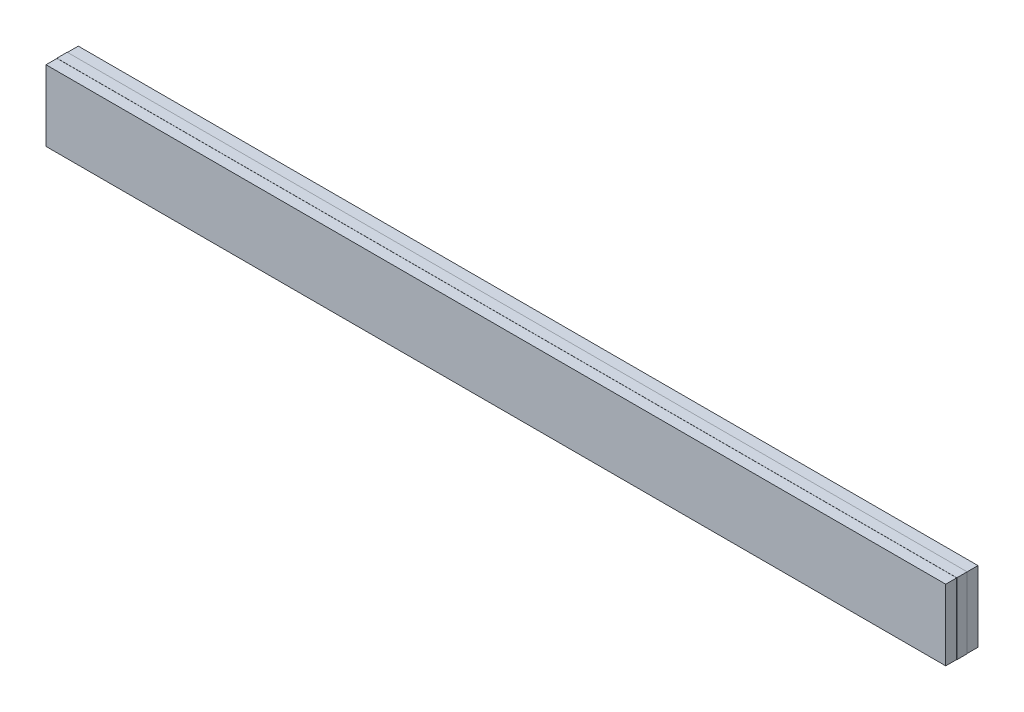
ISO-10303-21;
HEADER;
FILE_DESCRIPTION(('STEP AP214'),'2;1');
FILE_NAME('part.step','',(''),(''),'','','');
FILE_SCHEMA(('AUTOMOTIVE_DESIGN { 1 0 10303 214 1 1 1 1 }'));
ENDSEC;
DATA;
#1=APPLICATION_CONTEXT('core data for automotive mechanical design processes');
#2=APPLICATION_PROTOCOL_DEFINITION('international standard','automotive_design',2000,#1);
#3=PRODUCT_CONTEXT('',#1,'mechanical');
#4=PRODUCT('Part','Part','',(#3));
#5=PRODUCT_RELATED_PRODUCT_CATEGORY('part','',(#4));
#6=PRODUCT_DEFINITION_FORMATION('','',#4);
#7=PRODUCT_DEFINITION_CONTEXT('part definition',#1,'design');
#8=PRODUCT_DEFINITION('design','',#6,#7);
#9=PRODUCT_DEFINITION_SHAPE('','',#8);
#10=(LENGTH_UNIT() NAMED_UNIT(*) SI_UNIT(.MILLI.,.METRE.));
#11=(NAMED_UNIT(*) PLANE_ANGLE_UNIT() SI_UNIT($,.RADIAN.));
#12=(NAMED_UNIT(*) SI_UNIT($,.STERADIAN.) SOLID_ANGLE_UNIT());
#13=UNCERTAINTY_MEASURE_WITH_UNIT(LENGTH_MEASURE(1.E-05),#10,'distance_accuracy_value','');
#14=(GEOMETRIC_REPRESENTATION_CONTEXT(3) GLOBAL_UNCERTAINTY_ASSIGNED_CONTEXT((#13)) GLOBAL_UNIT_ASSIGNED_CONTEXT((#10,
#11,#12)) REPRESENTATION_CONTEXT('',''));
#15=CARTESIAN_POINT('',(0.,0.,0.));
#16=DIRECTION('',(0.,0.,1.));
#17=DIRECTION('',(1.,0.,0.));
#18=AXIS2_PLACEMENT_3D('',#15,#16,#17);
#19=CARTESIAN_POINT('',(0.,0.,-0.4));
#20=DIRECTION('',(0.,0.,1.));
#21=DIRECTION('',(1.,0.,0.));
#22=AXIS2_PLACEMENT_3D('',#19,#20,#21);
#23=PLANE('',#22);
#24=DIRECTION('',(0.,1.,0.));
#25=VECTOR('',#24,1.);
#26=CARTESIAN_POINT('',(34.85,2.75,-0.4));
#27=LINE('',#26,#25);
#28=CARTESIAN_POINT('',(34.85,-2.75,-0.4));
#29=VERTEX_POINT('',#28);
#30=CARTESIAN_POINT('',(34.85,2.75,-0.4));
#31=VERTEX_POINT('',#30);
#32=EDGE_CURVE('E177',#29,#31,#27,.T.);
#33=ORIENTED_EDGE('',*,*,#32,.F.);
#34=DIRECTION('',(1.,0.,0.));
#35=VECTOR('',#34,1.);
#36=CARTESIAN_POINT('',(-34.85,-2.75,-0.4));
#37=LINE('',#36,#35);
#38=CARTESIAN_POINT('',(-34.85,-2.75,-0.4));
#39=VERTEX_POINT('',#38);
#40=EDGE_CURVE('E182',#39,#29,#37,.T.);
#41=ORIENTED_EDGE('',*,*,#40,.F.);
#42=DIRECTION('',(0.,-1.,0.));
#43=VECTOR('',#42,1.);
#44=CARTESIAN_POINT('',(-34.85,2.75,-0.4));
#45=LINE('',#44,#43);
#46=CARTESIAN_POINT('',(-34.85,2.75,-0.4));
#47=VERTEX_POINT('',#46);
#48=EDGE_CURVE('E193',#47,#39,#45,.T.);
#49=ORIENTED_EDGE('',*,*,#48,.F.);
#50=DIRECTION('',(-1.,0.,0.));
#51=VECTOR('',#50,1.);
#52=CARTESIAN_POINT('',(-34.85,2.75,-0.4));
#53=LINE('',#52,#51);
#54=EDGE_CURVE('E191',#31,#47,#53,.T.);
#55=ORIENTED_EDGE('',*,*,#54,.F.);
#56=EDGE_LOOP('',(#33,#41,#49,#55));
#57=FACE_BOUND('',#56,.T.);
#58=DIRECTION('',(1.,0.,0.));
#59=VECTOR('',#58,1.);
#60=CARTESIAN_POINT('',(-34.84,2.74,-0.4));
#61=LINE('',#60,#59);
#62=CARTESIAN_POINT('',(-34.84,2.74,-0.4));
#63=VERTEX_POINT('',#62);
#64=CARTESIAN_POINT('',(34.84,2.74,-0.4));
#65=VERTEX_POINT('',#64);
#66=EDGE_CURVE('E142',#63,#65,#61,.T.);
#67=ORIENTED_EDGE('',*,*,#66,.F.);
#68=DIRECTION('',(0.,1.,0.));
#69=VECTOR('',#68,1.);
#70=CARTESIAN_POINT('',(-34.84,-2.74,-0.4));
#71=LINE('',#70,#69);
#72=CARTESIAN_POINT('',(-34.84,-2.74,-0.4));
#73=VERTEX_POINT('',#72);
#74=EDGE_CURVE('E139',#73,#63,#71,.T.);
#75=ORIENTED_EDGE('',*,*,#74,.F.);
#76=DIRECTION('',(-1.,0.,0.));
#77=VECTOR('',#76,1.);
#78=CARTESIAN_POINT('',(34.84,-2.74,-0.4));
#79=LINE('',#78,#77);
#80=CARTESIAN_POINT('',(34.84,-2.74,-0.4));
#81=VERTEX_POINT('',#80);
#82=EDGE_CURVE('E53',#81,#73,#79,.T.);
#83=ORIENTED_EDGE('',*,*,#82,.F.);
#84=DIRECTION('',(0.,-1.,0.));
#85=VECTOR('',#84,1.);
#86=CARTESIAN_POINT('',(34.84,2.74,-0.4));
#87=LINE('',#86,#85);
#88=EDGE_CURVE('E48',#65,#81,#87,.T.);
#89=ORIENTED_EDGE('',*,*,#88,.F.);
#90=EDGE_LOOP('',(#67,#75,#83,#89));
#91=FACE_BOUND('',#90,.T.);
#92=ADVANCED_FACE('F33',(#57,#91),#23,.F.);
#93=CARTESIAN_POINT('',(0.,0.,0.4));
#94=DIRECTION('',(0.,0.,1.));
#95=DIRECTION('',(1.,0.,0.));
#96=AXIS2_PLACEMENT_3D('',#93,#94,#95);
#97=PLANE('',#96);
#98=DIRECTION('',(0.,1.,0.));
#99=VECTOR('',#98,1.);
#100=CARTESIAN_POINT('',(34.85,2.75,0.4));
#101=LINE('',#100,#99);
#102=CARTESIAN_POINT('',(34.85,-2.75,0.4));
#103=VERTEX_POINT('',#102);
#104=CARTESIAN_POINT('',(34.85,2.75,0.4));
#105=VERTEX_POINT('',#104);
#106=EDGE_CURVE('E178',#103,#105,#101,.T.);
#107=ORIENTED_EDGE('',*,*,#106,.T.);
#108=DIRECTION('',(-1.,0.,0.));
#109=VECTOR('',#108,1.);
#110=CARTESIAN_POINT('',(-34.85,2.75,0.4));
#111=LINE('',#110,#109);
#112=CARTESIAN_POINT('',(-34.85,2.75,0.4));
#113=VERTEX_POINT('',#112);
#114=EDGE_CURVE('E181',#105,#113,#111,.T.);
#115=ORIENTED_EDGE('',*,*,#114,.T.);
#116=DIRECTION('',(0.,-1.,0.));
#117=VECTOR('',#116,1.);
#118=CARTESIAN_POINT('',(-34.85,2.75,0.4));
#119=LINE('',#118,#117);
#120=CARTESIAN_POINT('',(-34.85,-2.75,0.4));
#121=VERTEX_POINT('',#120);
#122=EDGE_CURVE('E184',#113,#121,#119,.T.);
#123=ORIENTED_EDGE('',*,*,#122,.T.);
#124=DIRECTION('',(1.,0.,0.));
#125=VECTOR('',#124,1.);
#126=CARTESIAN_POINT('',(-34.85,-2.75,0.4));
#127=LINE('',#126,#125);
#128=EDGE_CURVE('E186',#121,#103,#127,.T.);
#129=ORIENTED_EDGE('',*,*,#128,.T.);
#130=EDGE_LOOP('',(#107,#115,#123,#129));
#131=FACE_BOUND('',#130,.T.);
#132=DIRECTION('',(0.,1.,0.));
#133=VECTOR('',#132,1.);
#134=CARTESIAN_POINT('',(34.84,-2.74,0.4));
#135=LINE('',#134,#133);
#136=CARTESIAN_POINT('',(34.84,-2.74,0.4));
#137=VERTEX_POINT('',#136);
#138=CARTESIAN_POINT('',(34.84,2.74,0.4));
#139=VERTEX_POINT('',#138);
#140=EDGE_CURVE('E146',#137,#139,#135,.T.);
#141=ORIENTED_EDGE('',*,*,#140,.F.);
#142=DIRECTION('',(1.,0.,0.));
#143=VECTOR('',#142,1.);
#144=CARTESIAN_POINT('',(-34.84,-2.74,0.4));
#145=LINE('',#144,#143);
#146=CARTESIAN_POINT('',(-34.84,-2.74,0.4));
#147=VERTEX_POINT('',#146);
#148=EDGE_CURVE('E143',#147,#137,#145,.T.);
#149=ORIENTED_EDGE('',*,*,#148,.F.);
#150=DIRECTION('',(0.,-1.,0.));
#151=VECTOR('',#150,1.);
#152=CARTESIAN_POINT('',(-34.84,2.74,0.4));
#153=LINE('',#152,#151);
#154=CARTESIAN_POINT('',(-34.84,2.74,0.4));
#155=VERTEX_POINT('',#154);
#156=EDGE_CURVE('E156',#155,#147,#153,.T.);
#157=ORIENTED_EDGE('',*,*,#156,.F.);
#158=DIRECTION('',(-1.,0.,0.));
#159=VECTOR('',#158,1.);
#160=CARTESIAN_POINT('',(34.84,2.74,0.4));
#161=LINE('',#160,#159);
#162=EDGE_CURVE('E164',#139,#155,#161,.T.);
#163=ORIENTED_EDGE('',*,*,#162,.F.);
#164=EDGE_LOOP('',(#141,#149,#157,#163));
#165=FACE_BOUND('',#164,.T.);
#166=ADVANCED_FACE('F219',(#131,#165),#97,.T.);
#167=CARTESIAN_POINT('',(34.85,2.75,0.4));
#168=DIRECTION('',(-1.,0.,0.));
#169=DIRECTION('',(0.,0.,1.));
#170=AXIS2_PLACEMENT_3D('',#167,#168,#169);
#171=PLANE('',#170);
#172=ORIENTED_EDGE('',*,*,#32,.T.);
#173=DIRECTION('',(0.,0.,-1.));
#174=VECTOR('',#173,1.);
#175=CARTESIAN_POINT('',(34.85,2.75,0.4));
#176=LINE('',#175,#174);
#177=EDGE_CURVE('E11',#105,#31,#176,.T.);
#178=ORIENTED_EDGE('',*,*,#177,.F.);
#179=ORIENTED_EDGE('',*,*,#106,.F.);
#180=DIRECTION('',(0.,0.,-1.));
#181=VECTOR('',#180,1.);
#182=CARTESIAN_POINT('',(34.85,-2.75,0.4));
#183=LINE('',#182,#181);
#184=EDGE_CURVE('E188',#103,#29,#183,.T.);
#185=ORIENTED_EDGE('',*,*,#184,.T.);
#186=EDGE_LOOP('',(#172,#178,#179,#185));
#187=FACE_BOUND('',#186,.T.);
#188=ADVANCED_FACE('F35',(#187),#171,.F.);
#189=CARTESIAN_POINT('',(-34.85,2.75,0.4));
#190=DIRECTION('',(0.,-1.,0.));
#191=DIRECTION('',(0.,0.,-1.));
#192=AXIS2_PLACEMENT_3D('',#189,#190,#191);
#193=PLANE('',#192);
#194=ORIENTED_EDGE('',*,*,#54,.T.);
#195=DIRECTION('',(0.,0.,-1.));
#196=VECTOR('',#195,1.);
#197=CARTESIAN_POINT('',(-34.85,2.75,0.4));
#198=LINE('',#197,#196);
#199=EDGE_CURVE('E41',#113,#47,#198,.T.);
#200=ORIENTED_EDGE('',*,*,#199,.F.);
#201=ORIENTED_EDGE('',*,*,#114,.F.);
#202=ORIENTED_EDGE('',*,*,#177,.T.);
#203=EDGE_LOOP('',(#194,#200,#201,#202));
#204=FACE_BOUND('',#203,.T.);
#205=ADVANCED_FACE('F221',(#204),#193,.F.);
#206=CARTESIAN_POINT('',(-34.85,2.75,0.4));
#207=DIRECTION('',(1.,0.,0.));
#208=DIRECTION('',(0.,0.,-1.));
#209=AXIS2_PLACEMENT_3D('',#206,#207,#208);
#210=PLANE('',#209);
#211=ORIENTED_EDGE('',*,*,#48,.T.);
#212=DIRECTION('',(0.,0.,-1.));
#213=VECTOR('',#212,1.);
#214=CARTESIAN_POINT('',(-34.85,-2.75,0.4));
#215=LINE('',#214,#213);
#216=EDGE_CURVE('E198',#121,#39,#215,.T.);
#217=ORIENTED_EDGE('',*,*,#216,.F.);
#218=ORIENTED_EDGE('',*,*,#122,.F.);
#219=ORIENTED_EDGE('',*,*,#199,.T.);
#220=EDGE_LOOP('',(#211,#217,#218,#219));
#221=FACE_BOUND('',#220,.T.);
#222=ADVANCED_FACE('F205',(#221),#210,.F.);
#223=CARTESIAN_POINT('',(-34.85,-2.75,0.4));
#224=DIRECTION('',(0.,1.,0.));
#225=DIRECTION('',(0.,0.,1.));
#226=AXIS2_PLACEMENT_3D('',#223,#224,#225);
#227=PLANE('',#226);
#228=ORIENTED_EDGE('',*,*,#40,.T.);
#229=ORIENTED_EDGE('',*,*,#184,.F.);
#230=ORIENTED_EDGE('',*,*,#128,.F.);
#231=ORIENTED_EDGE('',*,*,#216,.T.);
#232=EDGE_LOOP('',(#228,#229,#230,#231));
#233=FACE_BOUND('',#232,.T.);
#234=ADVANCED_FACE('F213',(#233),#227,.F.);
#235=CARTESIAN_POINT('',(-34.84,-2.74,1.25));
#236=DIRECTION('',(0.,1.,0.));
#237=DIRECTION('',(0.,0.,1.));
#238=AXIS2_PLACEMENT_3D('',#235,#236,#237);
#239=PLANE('',#238);
#240=ORIENTED_EDGE('',*,*,#148,.T.);
#241=DIRECTION('',(0.,0.,-1.));
#242=VECTOR('',#241,1.);
#243=CARTESIAN_POINT('',(34.84,-2.74,1.25));
#244=LINE('',#243,#242);
#245=CARTESIAN_POINT('',(34.84,-2.74,1.25));
#246=VERTEX_POINT('',#245);
#247=EDGE_CURVE('E175',#246,#137,#244,.T.);
#248=ORIENTED_EDGE('',*,*,#247,.F.);
#249=DIRECTION('',(1.,0.,0.));
#250=VECTOR('',#249,1.);
#251=CARTESIAN_POINT('',(-34.84,-2.74,1.25));
#252=LINE('',#251,#250);
#253=CARTESIAN_POINT('',(-34.84,-2.74,1.25));
#254=VERTEX_POINT('',#253);
#255=EDGE_CURVE('E152',#254,#246,#252,.T.);
#256=ORIENTED_EDGE('',*,*,#255,.F.);
#257=DIRECTION('',(0.,0.,-1.));
#258=VECTOR('',#257,1.);
#259=CARTESIAN_POINT('',(-34.84,-2.74,1.25));
#260=LINE('',#259,#258);
#261=EDGE_CURVE('E161',#254,#147,#260,.T.);
#262=ORIENTED_EDGE('',*,*,#261,.T.);
#263=EDGE_LOOP('',(#240,#248,#256,#262));
#264=FACE_BOUND('',#263,.T.);
#265=ADVANCED_FACE('F237',(#264),#239,.F.);
#266=CARTESIAN_POINT('',(34.84,-2.74,1.25));
#267=DIRECTION('',(-1.,0.,0.));
#268=DIRECTION('',(0.,0.,1.));
#269=AXIS2_PLACEMENT_3D('',#266,#267,#268);
#270=PLANE('',#269);
#271=ORIENTED_EDGE('',*,*,#140,.T.);
#272=DIRECTION('',(0.,0.,-1.));
#273=VECTOR('',#272,1.);
#274=CARTESIAN_POINT('',(34.84,2.74,1.25));
#275=LINE('',#274,#273);
#276=CARTESIAN_POINT('',(34.84,2.74,1.25));
#277=VERTEX_POINT('',#276);
#278=EDGE_CURVE('E172',#277,#139,#275,.T.);
#279=ORIENTED_EDGE('',*,*,#278,.F.);
#280=DIRECTION('',(0.,1.,0.));
#281=VECTOR('',#280,1.);
#282=CARTESIAN_POINT('',(34.84,-2.74,1.25));
#283=LINE('',#282,#281);
#284=EDGE_CURVE('E155',#246,#277,#283,.T.);
#285=ORIENTED_EDGE('',*,*,#284,.F.);
#286=ORIENTED_EDGE('',*,*,#247,.T.);
#287=EDGE_LOOP('',(#271,#279,#285,#286));
#288=FACE_BOUND('',#287,.T.);
#289=ADVANCED_FACE('F241',(#288),#270,.F.);
#290=CARTESIAN_POINT('',(34.84,2.74,1.25));
#291=DIRECTION('',(0.,-1.,0.));
#292=DIRECTION('',(0.,0.,-1.));
#293=AXIS2_PLACEMENT_3D('',#290,#291,#292);
#294=PLANE('',#293);
#295=ORIENTED_EDGE('',*,*,#162,.T.);
#296=DIRECTION('',(0.,0.,-1.));
#297=VECTOR('',#296,1.);
#298=CARTESIAN_POINT('',(-34.84,2.74,1.25));
#299=LINE('',#298,#297);
#300=CARTESIAN_POINT('',(-34.84,2.74,1.25));
#301=VERTEX_POINT('',#300);
#302=EDGE_CURVE('E170',#301,#155,#299,.T.);
#303=ORIENTED_EDGE('',*,*,#302,.F.);
#304=DIRECTION('',(-1.,0.,0.));
#305=VECTOR('',#304,1.);
#306=CARTESIAN_POINT('',(34.84,2.74,1.25));
#307=LINE('',#306,#305);
#308=EDGE_CURVE('E158',#277,#301,#307,.T.);
#309=ORIENTED_EDGE('',*,*,#308,.F.);
#310=ORIENTED_EDGE('',*,*,#278,.T.);
#311=EDGE_LOOP('',(#295,#303,#309,#310));
#312=FACE_BOUND('',#311,.T.);
#313=ADVANCED_FACE('F246',(#312),#294,.F.);
#314=CARTESIAN_POINT('',(-34.84,2.74,1.25));
#315=DIRECTION('',(1.,0.,0.));
#316=DIRECTION('',(0.,0.,-1.));
#317=AXIS2_PLACEMENT_3D('',#314,#315,#316);
#318=PLANE('',#317);
#319=ORIENTED_EDGE('',*,*,#156,.T.);
#320=ORIENTED_EDGE('',*,*,#261,.F.);
#321=DIRECTION('',(0.,-1.,0.));
#322=VECTOR('',#321,1.);
#323=CARTESIAN_POINT('',(-34.84,2.74,1.25));
#324=LINE('',#323,#322);
#325=EDGE_CURVE('E160',#301,#254,#324,.T.);
#326=ORIENTED_EDGE('',*,*,#325,.F.);
#327=ORIENTED_EDGE('',*,*,#302,.T.);
#328=EDGE_LOOP('',(#319,#320,#326,#327));
#329=FACE_BOUND('',#328,.T.);
#330=ADVANCED_FACE('F252',(#329),#318,.F.);
#331=CARTESIAN_POINT('',(0.,0.,1.25));
#332=DIRECTION('',(0.,0.,1.));
#333=DIRECTION('',(1.,0.,0.));
#334=AXIS2_PLACEMENT_3D('',#331,#332,#333);
#335=PLANE('',#334);
#336=ORIENTED_EDGE('',*,*,#255,.T.);
#337=ORIENTED_EDGE('',*,*,#284,.T.);
#338=ORIENTED_EDGE('',*,*,#308,.T.);
#339=ORIENTED_EDGE('',*,*,#325,.T.);
#340=EDGE_LOOP('',(#336,#337,#338,#339));
#341=FACE_BOUND('',#340,.T.);
#342=ADVANCED_FACE('F256',(#341),#335,.T.);
#343=CARTESIAN_POINT('',(-34.84,2.74,-1.25));
#344=DIRECTION('',(0.,-1.,0.));
#345=DIRECTION('',(0.,0.,-1.));
#346=AXIS2_PLACEMENT_3D('',#343,#344,#345);
#347=PLANE('',#346);
#348=ORIENTED_EDGE('',*,*,#66,.T.);
#349=DIRECTION('',(0.,0.,1.));
#350=VECTOR('',#349,1.);
#351=CARTESIAN_POINT('',(34.84,2.74,-1.25));
#352=LINE('',#351,#350);
#353=CARTESIAN_POINT('',(34.84,2.74,-1.25));
#354=VERTEX_POINT('',#353);
#355=EDGE_CURVE('E123',#354,#65,#352,.T.);
#356=ORIENTED_EDGE('',*,*,#355,.F.);
#357=DIRECTION('',(1.,0.,0.));
#358=VECTOR('',#357,1.);
#359=CARTESIAN_POINT('',(-34.84,2.74,-1.25));
#360=LINE('',#359,#358);
#361=CARTESIAN_POINT('',(-34.84,2.74,-1.25));
#362=VERTEX_POINT('',#361);
#363=EDGE_CURVE('E130',#362,#354,#360,.T.);
#364=ORIENTED_EDGE('',*,*,#363,.F.);
#365=DIRECTION('',(0.,0.,1.));
#366=VECTOR('',#365,1.);
#367=CARTESIAN_POINT('',(-34.84,2.74,-1.25));
#368=LINE('',#367,#366);
#369=EDGE_CURVE('E364',#362,#63,#368,.T.);
#370=ORIENTED_EDGE('',*,*,#369,.T.);
#371=EDGE_LOOP('',(#348,#356,#364,#370));
#372=FACE_BOUND('',#371,.T.);
#373=ADVANCED_FACE('F141',(#372),#347,.F.);
#374=CARTESIAN_POINT('',(34.84,2.74,-1.25));
#375=DIRECTION('',(-1.,0.,0.));
#376=DIRECTION('',(0.,0.,1.));
#377=AXIS2_PLACEMENT_3D('',#374,#375,#376);
#378=PLANE('',#377);
#379=ORIENTED_EDGE('',*,*,#88,.T.);
#380=DIRECTION('',(0.,0.,1.));
#381=VECTOR('',#380,1.);
#382=CARTESIAN_POINT('',(34.84,-2.74,-1.25));
#383=LINE('',#382,#381);
#384=CARTESIAN_POINT('',(34.84,-2.74,-1.25));
#385=VERTEX_POINT('',#384);
#386=EDGE_CURVE('E126',#385,#81,#383,.T.);
#387=ORIENTED_EDGE('',*,*,#386,.F.);
#388=DIRECTION('',(0.,-1.,0.));
#389=VECTOR('',#388,1.);
#390=CARTESIAN_POINT('',(34.84,2.74,-1.25));
#391=LINE('',#390,#389);
#392=EDGE_CURVE('E119',#354,#385,#391,.T.);
#393=ORIENTED_EDGE('',*,*,#392,.F.);
#394=ORIENTED_EDGE('',*,*,#355,.T.);
#395=EDGE_LOOP('',(#379,#387,#393,#394));
#396=FACE_BOUND('',#395,.T.);
#397=ADVANCED_FACE('F121',(#396),#378,.F.);
#398=CARTESIAN_POINT('',(34.84,-2.74,-1.25));
#399=DIRECTION('',(0.,1.,0.));
#400=DIRECTION('',(0.,0.,1.));
#401=AXIS2_PLACEMENT_3D('',#398,#399,#400);
#402=PLANE('',#401);
#403=ORIENTED_EDGE('',*,*,#82,.T.);
#404=DIRECTION('',(0.,0.,1.));
#405=VECTOR('',#404,1.);
#406=CARTESIAN_POINT('',(-34.84,-2.74,-1.25));
#407=LINE('',#406,#405);
#408=CARTESIAN_POINT('',(-34.84,-2.74,-1.25));
#409=VERTEX_POINT('',#408);
#410=EDGE_CURVE('E148',#409,#73,#407,.T.);
#411=ORIENTED_EDGE('',*,*,#410,.F.);
#412=DIRECTION('',(-1.,0.,0.));
#413=VECTOR('',#412,1.);
#414=CARTESIAN_POINT('',(34.84,-2.74,-1.25));
#415=LINE('',#414,#413);
#416=EDGE_CURVE('E129',#385,#409,#415,.T.);
#417=ORIENTED_EDGE('',*,*,#416,.F.);
#418=ORIENTED_EDGE('',*,*,#386,.T.);
#419=EDGE_LOOP('',(#403,#411,#417,#418));
#420=FACE_BOUND('',#419,.T.);
#421=ADVANCED_FACE('F265',(#420),#402,.F.);
#422=CARTESIAN_POINT('',(-34.84,-2.74,-1.25));
#423=DIRECTION('',(1.,0.,0.));
#424=DIRECTION('',(0.,0.,-1.));
#425=AXIS2_PLACEMENT_3D('',#422,#423,#424);
#426=PLANE('',#425);
#427=ORIENTED_EDGE('',*,*,#74,.T.);
#428=ORIENTED_EDGE('',*,*,#369,.F.);
#429=DIRECTION('',(0.,1.,0.));
#430=VECTOR('',#429,1.);
#431=CARTESIAN_POINT('',(-34.84,-2.74,-1.25));
#432=LINE('',#431,#430);
#433=EDGE_CURVE('E135',#409,#362,#432,.T.);
#434=ORIENTED_EDGE('',*,*,#433,.F.);
#435=ORIENTED_EDGE('',*,*,#410,.T.);
#436=EDGE_LOOP('',(#427,#428,#434,#435));
#437=FACE_BOUND('',#436,.T.);
#438=ADVANCED_FACE('F268',(#437),#426,.F.);
#439=CARTESIAN_POINT('',(0.,0.,-1.25));
#440=DIRECTION('',(0.,0.,-1.));
#441=DIRECTION('',(-1.,0.,0.));
#442=AXIS2_PLACEMENT_3D('',#439,#440,#441);
#443=PLANE('',#442);
#444=ORIENTED_EDGE('',*,*,#363,.T.);
#445=ORIENTED_EDGE('',*,*,#392,.T.);
#446=ORIENTED_EDGE('',*,*,#416,.T.);
#447=ORIENTED_EDGE('',*,*,#433,.T.);
#448=EDGE_LOOP('',(#444,#445,#446,#447));
#449=FACE_BOUND('',#448,.T.);
#450=ADVANCED_FACE('F133',(#449),#443,.T.);
#451=CLOSED_SHELL('',(#92,#166,#188,#205,#222,#234,#265,#289,#313,#330,#342,#373,#397,#421,#438,#450));
#452=MANIFOLD_SOLID_BREP('B2',#451);
#453=ADVANCED_BREP_SHAPE_REPRESENTATION('',(#18,#452),#14);
#454=SHAPE_DEFINITION_REPRESENTATION(#9,#453);
ENDSEC;
END-ISO-10303-21;
